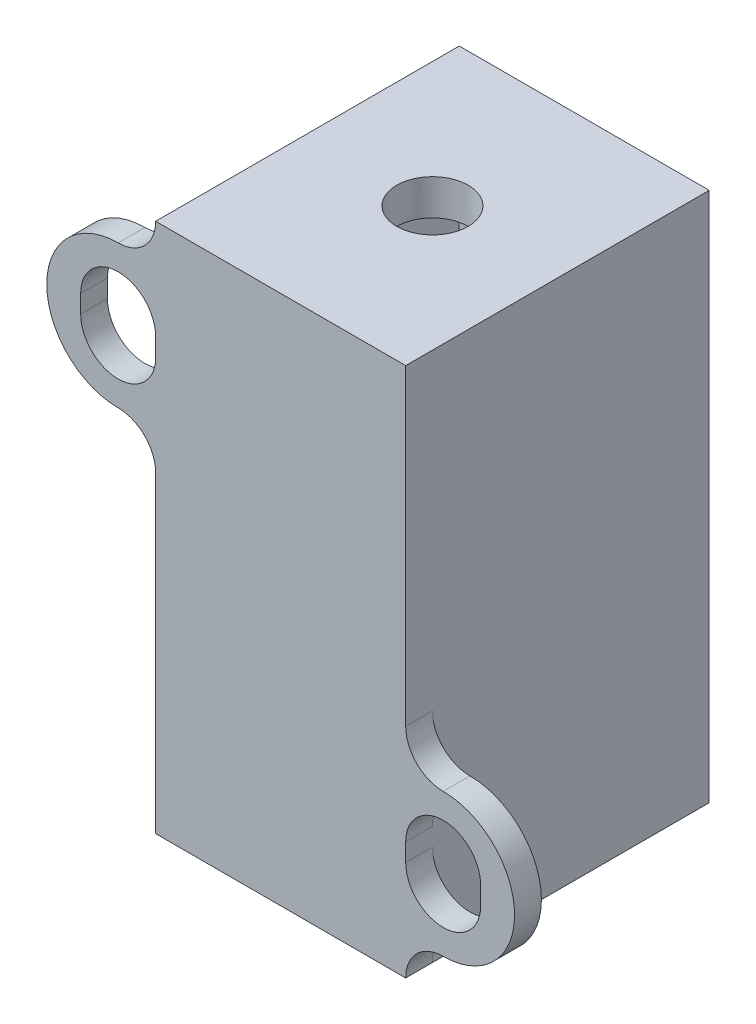
ISO-10303-21;
HEADER;
FILE_DESCRIPTION(('STEP AP214'),'2;1');
FILE_NAME('part.step','',(''),(''),'','','');
FILE_SCHEMA(('AUTOMOTIVE_DESIGN { 1 0 10303 214 1 1 1 1 }'));
ENDSEC;
DATA;
#1=APPLICATION_CONTEXT('core data for automotive mechanical design processes');
#2=APPLICATION_PROTOCOL_DEFINITION('international standard','automotive_design',2000,#1);
#3=PRODUCT_CONTEXT('',#1,'mechanical');
#4=PRODUCT('Part','Part','',(#3));
#5=PRODUCT_RELATED_PRODUCT_CATEGORY('part','',(#4));
#6=PRODUCT_DEFINITION_FORMATION('','',#4);
#7=PRODUCT_DEFINITION_CONTEXT('part definition',#1,'design');
#8=PRODUCT_DEFINITION('design','',#6,#7);
#9=PRODUCT_DEFINITION_SHAPE('','',#8);
#10=(LENGTH_UNIT() NAMED_UNIT(*) SI_UNIT(.MILLI.,.METRE.));
#11=(NAMED_UNIT(*) PLANE_ANGLE_UNIT() SI_UNIT($,.RADIAN.));
#12=(NAMED_UNIT(*) SI_UNIT($,.STERADIAN.) SOLID_ANGLE_UNIT());
#13=UNCERTAINTY_MEASURE_WITH_UNIT(LENGTH_MEASURE(1.E-05),#10,'distance_accuracy_value','');
#14=(GEOMETRIC_REPRESENTATION_CONTEXT(3) GLOBAL_UNCERTAINTY_ASSIGNED_CONTEXT((#13)) GLOBAL_UNIT_ASSIGNED_CONTEXT((#10,
#11,#12)) REPRESENTATION_CONTEXT('',''));
#15=CARTESIAN_POINT('',(0.,0.,0.));
#16=DIRECTION('',(0.,0.,1.));
#17=DIRECTION('',(1.,0.,0.));
#18=AXIS2_PLACEMENT_3D('',#15,#16,#17);
#19=CARTESIAN_POINT('',(14.,0.,17.));
#20=DIRECTION('',(-1.,0.,0.));
#21=DIRECTION('',(0.,0.,1.));
#22=AXIS2_PLACEMENT_3D('',#19,#20,#21);
#23=PLANE('',#22);
#24=DIRECTION('',(0.,0.,1.));
#25=VECTOR('',#24,1.);
#26=CARTESIAN_POINT('',(14.,5.6,15.5));
#27=LINE('',#26,#25);
#28=CARTESIAN_POINT('',(14.,5.6,15.5));
#29=VERTEX_POINT('',#28);
#30=CARTESIAN_POINT('',(14.,5.6,17.));
#31=VERTEX_POINT('',#30);
#32=EDGE_CURVE('E240',#29,#31,#27,.T.);
#33=ORIENTED_EDGE('',*,*,#32,.F.);
#34=DIRECTION('',(0.,1.,0.));
#35=VECTOR('',#34,1.);
#36=CARTESIAN_POINT('',(14.,0.,15.5));
#37=LINE('',#36,#35);
#38=CARTESIAN_POINT('',(14.,0.,15.5));
#39=VERTEX_POINT('',#38);
#40=EDGE_CURVE('E206',#39,#29,#37,.T.);
#41=ORIENTED_EDGE('',*,*,#40,.F.);
#42=DIRECTION('',(0.,0.,-1.));
#43=VECTOR('',#42,1.);
#44=CARTESIAN_POINT('',(14.,0.,17.));
#45=LINE('',#44,#43);
#46=CARTESIAN_POINT('',(14.,0.,0.));
#47=VERTEX_POINT('',#46);
#48=EDGE_CURVE('E371',#39,#47,#45,.T.);
#49=ORIENTED_EDGE('',*,*,#48,.T.);
#50=DIRECTION('',(0.,1.,0.));
#51=VECTOR('',#50,1.);
#52=CARTESIAN_POINT('',(14.,0.,0.));
#53=LINE('',#52,#51);
#54=CARTESIAN_POINT('',(14.,29.7,0.));
#55=VERTEX_POINT('',#54);
#56=EDGE_CURVE('E361',#47,#55,#53,.T.);
#57=ORIENTED_EDGE('',*,*,#56,.T.);
#58=DIRECTION('',(0.,0.,-1.));
#59=VECTOR('',#58,1.);
#60=CARTESIAN_POINT('',(14.,29.7,17.));
#61=LINE('',#60,#59);
#62=CARTESIAN_POINT('',(14.,29.7,17.));
#63=VERTEX_POINT('',#62);
#64=EDGE_CURVE('E368',#63,#55,#61,.T.);
#65=ORIENTED_EDGE('',*,*,#64,.F.);
#66=DIRECTION('',(0.,1.,0.));
#67=VECTOR('',#66,1.);
#68=CARTESIAN_POINT('',(14.,0.,17.));
#69=LINE('',#68,#67);
#70=CARTESIAN_POINT('',(14.,12.2,17.));
#71=VERTEX_POINT('',#70);
#72=EDGE_CURVE('E349',#71,#63,#69,.T.);
#73=ORIENTED_EDGE('',*,*,#72,.F.);
#74=DIRECTION('',(0.,0.,1.));
#75=VECTOR('',#74,1.);
#76=CARTESIAN_POINT('',(14.,12.2,15.5));
#77=LINE('',#76,#75);
#78=CARTESIAN_POINT('',(14.,12.2,15.5));
#79=VERTEX_POINT('',#78);
#80=EDGE_CURVE('E250',#79,#71,#77,.T.);
#81=ORIENTED_EDGE('',*,*,#80,.F.);
#82=CARTESIAN_POINT('',(14.,6.6,15.5));
#83=VERTEX_POINT('',#82);
#84=EDGE_CURVE('E220',#83,#79,#37,.T.);
#85=ORIENTED_EDGE('',*,*,#84,.F.);
#86=DIRECTION('',(0.,0.,1.));
#87=VECTOR('',#86,1.);
#88=CARTESIAN_POINT('',(14.,6.6,15.5));
#89=LINE('',#88,#87);
#90=CARTESIAN_POINT('',(14.,6.6,17.));
#91=VERTEX_POINT('',#90);
#92=EDGE_CURVE('E247',#83,#91,#89,.T.);
#93=ORIENTED_EDGE('',*,*,#92,.T.);
#94=EDGE_CURVE('E351',#31,#91,#69,.T.);
#95=ORIENTED_EDGE('',*,*,#94,.F.);
#96=EDGE_LOOP('',(#33,#41,#49,#57,#65,#73,#81,#85,#93,#95));
#97=FACE_BOUND('',#96,.T.);
#98=ADVANCED_FACE('F37',(#97),#23,.F.);
#99=CARTESIAN_POINT('',(0.,0.,17.));
#100=DIRECTION('',(1.,0.,0.));
#101=DIRECTION('',(0.,0.,-1.));
#102=AXIS2_PLACEMENT_3D('',#99,#100,#101);
#103=PLANE('',#102);
#104=DIRECTION('',(0.,0.,1.));
#105=VECTOR('',#104,1.);
#106=CARTESIAN_POINT('',(0.,24.1,15.5));
#107=LINE('',#106,#105);
#108=CARTESIAN_POINT('',(0.,24.1,15.5));
#109=VERTEX_POINT('',#108);
#110=CARTESIAN_POINT('',(0.,24.1,17.));
#111=VERTEX_POINT('',#110);
#112=EDGE_CURVE('E289',#109,#111,#107,.T.);
#113=ORIENTED_EDGE('',*,*,#112,.F.);
#114=DIRECTION('',(0.,-1.,0.));
#115=VECTOR('',#114,1.);
#116=CARTESIAN_POINT('',(0.,0.,15.5));
#117=LINE('',#116,#115);
#118=CARTESIAN_POINT('',(0.,29.7,15.5));
#119=VERTEX_POINT('',#118);
#120=EDGE_CURVE('E263',#119,#109,#117,.T.);
#121=ORIENTED_EDGE('',*,*,#120,.F.);
#122=DIRECTION('',(0.,0.,-1.));
#123=VECTOR('',#122,1.);
#124=CARTESIAN_POINT('',(0.,29.7,17.));
#125=LINE('',#124,#123);
#126=CARTESIAN_POINT('',(0.,29.7,0.));
#127=VERTEX_POINT('',#126);
#128=EDGE_CURVE('E355',#119,#127,#125,.T.);
#129=ORIENTED_EDGE('',*,*,#128,.T.);
#130=DIRECTION('',(0.,-1.,0.));
#131=VECTOR('',#130,1.);
#132=CARTESIAN_POINT('',(0.,0.,0.));
#133=LINE('',#132,#131);
#134=CARTESIAN_POINT('',(0.,0.,0.));
#135=VERTEX_POINT('',#134);
#136=EDGE_CURVE('E341',#127,#135,#133,.T.);
#137=ORIENTED_EDGE('',*,*,#136,.T.);
#138=DIRECTION('',(0.,0.,-1.));
#139=VECTOR('',#138,1.);
#140=CARTESIAN_POINT('',(0.,0.,17.));
#141=LINE('',#140,#139);
#142=CARTESIAN_POINT('',(0.,0.,17.));
#143=VERTEX_POINT('',#142);
#144=EDGE_CURVE('E11',#143,#135,#141,.T.);
#145=ORIENTED_EDGE('',*,*,#144,.F.);
#146=DIRECTION('',(0.,-1.,0.));
#147=VECTOR('',#146,1.);
#148=CARTESIAN_POINT('',(0.,0.,17.));
#149=LINE('',#148,#147);
#150=CARTESIAN_POINT('',(0.,17.5,17.));
#151=VERTEX_POINT('',#150);
#152=EDGE_CURVE('E342',#151,#143,#149,.T.);
#153=ORIENTED_EDGE('',*,*,#152,.F.);
#154=DIRECTION('',(0.,0.,1.));
#155=VECTOR('',#154,1.);
#156=CARTESIAN_POINT('',(0.,17.5,15.5));
#157=LINE('',#156,#155);
#158=CARTESIAN_POINT('',(0.,17.5,15.5));
#159=VERTEX_POINT('',#158);
#160=EDGE_CURVE('E299',#159,#151,#157,.T.);
#161=ORIENTED_EDGE('',*,*,#160,.F.);
#162=CARTESIAN_POINT('',(0.,23.1,15.5));
#163=VERTEX_POINT('',#162);
#164=EDGE_CURVE('E260',#163,#159,#117,.T.);
#165=ORIENTED_EDGE('',*,*,#164,.F.);
#166=DIRECTION('',(0.,0.,1.));
#167=VECTOR('',#166,1.);
#168=CARTESIAN_POINT('',(0.,23.1,15.5));
#169=LINE('',#168,#167);
#170=CARTESIAN_POINT('',(0.,23.1,17.));
#171=VERTEX_POINT('',#170);
#172=EDGE_CURVE('E296',#163,#171,#169,.T.);
#173=ORIENTED_EDGE('',*,*,#172,.T.);
#174=EDGE_CURVE('E344',#111,#171,#149,.T.);
#175=ORIENTED_EDGE('',*,*,#174,.F.);
#176=EDGE_LOOP('',(#113,#121,#129,#137,#145,#153,#161,#165,#173,#175));
#177=FACE_BOUND('',#176,.T.);
#178=ADVANCED_FACE('F39',(#177),#103,.F.);
#179=CARTESIAN_POINT('',(7.,0.,8.5));
#180=DIRECTION('',(0.,1.,0.));
#181=DIRECTION('',(0.,0.,1.));
#182=AXIS2_PLACEMENT_3D('',#179,#180,#181);
#183=CYLINDRICAL_SURFACE('',#182,2.);
#184=CARTESIAN_POINT('',(7.,29.7,8.5));
#185=DIRECTION('',(0.,1.,0.));
#186=DIRECTION('',(0.,0.,1.));
#187=AXIS2_PLACEMENT_3D('',#184,#185,#186);
#188=CIRCLE('',#187,2.);
#189=CARTESIAN_POINT('',(7.,29.7,10.5));
#190=VERTEX_POINT('',#189);
#191=EDGE_CURVE('E338',#190,#190,#188,.T.);
#192=ORIENTED_EDGE('',*,*,#191,.T.);
#193=EDGE_LOOP('',(#192));
#194=FACE_BOUND('',#193,.T.);
#195=CARTESIAN_POINT('',(7.,27.7,8.5));
#196=DIRECTION('',(0.,-1.,0.));
#197=DIRECTION('',(0.,0.,-1.));
#198=AXIS2_PLACEMENT_3D('',#195,#196,#197);
#199=CIRCLE('',#198,2.);
#200=CARTESIAN_POINT('',(7.,27.7,6.50000000000001));
#201=VERTEX_POINT('',#200);
#202=EDGE_CURVE('E337',#201,#201,#199,.F.);
#203=ORIENTED_EDGE('',*,*,#202,.F.);
#204=EDGE_LOOP('',(#203));
#205=FACE_BOUND('',#204,.T.);
#206=ADVANCED_FACE('F378',(#194,#205),#183,.F.);
#207=CARTESIAN_POINT('',(0.,0.,17.));
#208=DIRECTION('',(0.,1.,0.));
#209=DIRECTION('',(0.,0.,1.));
#210=AXIS2_PLACEMENT_3D('',#207,#208,#209);
#211=PLANE('',#210);
#212=CARTESIAN_POINT('',(7.,0.,8.5));
#213=DIRECTION('',(0.,-1.,0.));
#214=DIRECTION('',(0.,0.,-1.));
#215=AXIS2_PLACEMENT_3D('',#212,#213,#214);
#216=CIRCLE('',#215,4.);
#217=CARTESIAN_POINT('',(7.,0.,4.5));
#218=VERTEX_POINT('',#217);
#219=EDGE_CURVE('E334',#218,#218,#216,.T.);
#220=ORIENTED_EDGE('',*,*,#219,.F.);
#221=EDGE_LOOP('',(#220));
#222=FACE_BOUND('',#221,.T.);
#223=DIRECTION('',(1.,0.,0.));
#224=VECTOR('',#223,1.);
#225=CARTESIAN_POINT('',(0.,0.,0.));
#226=LINE('',#225,#224);
#227=EDGE_CURVE('E358',#135,#47,#226,.T.);
#228=ORIENTED_EDGE('',*,*,#227,.T.);
#229=ORIENTED_EDGE('',*,*,#48,.F.);
#230=CARTESIAN_POINT('',(14.,0.,17.));
#231=VERTEX_POINT('',#230);
#232=EDGE_CURVE('E46',#231,#39,#45,.T.);
#233=ORIENTED_EDGE('',*,*,#232,.F.);
#234=DIRECTION('',(1.,0.,0.));
#235=VECTOR('',#234,1.);
#236=CARTESIAN_POINT('',(0.,0.,17.));
#237=LINE('',#236,#235);
#238=EDGE_CURVE('E346',#143,#231,#237,.T.);
#239=ORIENTED_EDGE('',*,*,#238,.F.);
#240=ORIENTED_EDGE('',*,*,#144,.T.);
#241=EDGE_LOOP('',(#228,#229,#233,#239,#240));
#242=FACE_BOUND('',#241,.T.);
#243=ADVANCED_FACE('F380',(#222,#242),#211,.F.);
#244=CARTESIAN_POINT('',(0.,29.7,17.));
#245=DIRECTION('',(0.,-1.,0.));
#246=DIRECTION('',(0.,0.,-1.));
#247=AXIS2_PLACEMENT_3D('',#244,#245,#246);
#248=PLANE('',#247);
#249=ORIENTED_EDGE('',*,*,#191,.F.);
#250=EDGE_LOOP('',(#249));
#251=FACE_BOUND('',#250,.T.);
#252=DIRECTION('',(-1.,0.,0.));
#253=VECTOR('',#252,1.);
#254=CARTESIAN_POINT('',(0.,29.7,0.));
#255=LINE('',#254,#253);
#256=EDGE_CURVE('E345',#55,#127,#255,.T.);
#257=ORIENTED_EDGE('',*,*,#256,.T.);
#258=ORIENTED_EDGE('',*,*,#128,.F.);
#259=CARTESIAN_POINT('',(0.,29.7,17.));
#260=VERTEX_POINT('',#259);
#261=EDGE_CURVE('E365',#260,#119,#125,.T.);
#262=ORIENTED_EDGE('',*,*,#261,.F.);
#263=DIRECTION('',(-1.,0.,0.));
#264=VECTOR('',#263,1.);
#265=CARTESIAN_POINT('',(0.,29.7,17.));
#266=LINE('',#265,#264);
#267=EDGE_CURVE('E352',#63,#260,#266,.T.);
#268=ORIENTED_EDGE('',*,*,#267,.F.);
#269=ORIENTED_EDGE('',*,*,#64,.T.);
#270=EDGE_LOOP('',(#257,#258,#262,#268,#269));
#271=FACE_BOUND('',#270,.T.);
#272=ADVANCED_FACE('F387',(#251,#271),#248,.F.);
#273=CARTESIAN_POINT('',(0.,0.,17.));
#274=DIRECTION('',(0.,0.,-1.));
#275=DIRECTION('',(-1.,0.,0.));
#276=AXIS2_PLACEMENT_3D('',#273,#274,#275);
#277=PLANE('',#276);
#278=CARTESIAN_POINT('',(16.1,5.6,17.));
#279=DIRECTION('',(0.,0.,1.));
#280=DIRECTION('',(1.,0.,0.));
#281=AXIS2_PLACEMENT_3D('',#278,#279,#280);
#282=CIRCLE('',#281,2.1);
#283=CARTESIAN_POINT('',(18.2,5.6,17.));
#284=VERTEX_POINT('',#283);
#285=EDGE_CURVE('E62',#31,#284,#282,.T.);
#286=ORIENTED_EDGE('',*,*,#285,.F.);
#287=ORIENTED_EDGE('',*,*,#94,.T.);
#288=CARTESIAN_POINT('',(16.1,6.6,17.));
#289=DIRECTION('',(0.,0.,1.));
#290=DIRECTION('',(1.,0.,0.));
#291=AXIS2_PLACEMENT_3D('',#288,#289,#290);
#292=CIRCLE('',#291,2.1);
#293=CARTESIAN_POINT('',(18.2,6.6,17.));
#294=VERTEX_POINT('',#293);
#295=EDGE_CURVE('E235',#294,#91,#292,.T.);
#296=ORIENTED_EDGE('',*,*,#295,.F.);
#297=DIRECTION('',(0.,-1.,0.));
#298=VECTOR('',#297,1.);
#299=CARTESIAN_POINT('',(18.2,0.,17.));
#300=LINE('',#299,#298);
#301=EDGE_CURVE('E237',#294,#284,#300,.T.);
#302=ORIENTED_EDGE('',*,*,#301,.T.);
#303=EDGE_LOOP('',(#286,#287,#296,#302));
#304=FACE_BOUND('',#303,.T.);
#305=CARTESIAN_POINT('',(-2.1,24.1,17.));
#306=DIRECTION('',(0.,0.,1.));
#307=DIRECTION('',(1.,0.,0.));
#308=AXIS2_PLACEMENT_3D('',#305,#306,#307);
#309=CIRCLE('',#308,2.1);
#310=CARTESIAN_POINT('',(-4.20000000000001,24.1,17.));
#311=VERTEX_POINT('',#310);
#312=EDGE_CURVE('E282',#111,#311,#309,.T.);
#313=ORIENTED_EDGE('',*,*,#312,.F.);
#314=ORIENTED_EDGE('',*,*,#174,.T.);
#315=CARTESIAN_POINT('',(-2.1,23.1,17.));
#316=DIRECTION('',(0.,0.,1.));
#317=DIRECTION('',(1.,0.,0.));
#318=AXIS2_PLACEMENT_3D('',#315,#316,#317);
#319=CIRCLE('',#318,2.1);
#320=CARTESIAN_POINT('',(-4.20000000000001,23.1,17.));
#321=VERTEX_POINT('',#320);
#322=EDGE_CURVE('E277',#321,#171,#319,.T.);
#323=ORIENTED_EDGE('',*,*,#322,.F.);
#324=DIRECTION('',(0.,1.,0.));
#325=VECTOR('',#324,1.);
#326=CARTESIAN_POINT('',(-4.20000000000001,0.,17.));
#327=LINE('',#326,#325);
#328=EDGE_CURVE('E279',#321,#311,#327,.T.);
#329=ORIENTED_EDGE('',*,*,#328,.T.);
#330=EDGE_LOOP('',(#313,#314,#323,#329));
#331=FACE_BOUND('',#330,.T.);
#332=ORIENTED_EDGE('',*,*,#267,.T.);
#333=CARTESIAN_POINT('',(-2.1,29.7,17.));
#334=DIRECTION('',(0.,0.,1.));
#335=DIRECTION('',(1.,0.,0.));
#336=AXIS2_PLACEMENT_3D('',#333,#334,#335);
#337=CIRCLE('',#336,2.1);
#338=CARTESIAN_POINT('',(-2.1,27.6,17.));
#339=VERTEX_POINT('',#338);
#340=EDGE_CURVE('E257',#339,#260,#337,.T.);
#341=ORIENTED_EDGE('',*,*,#340,.F.);
#342=CARTESIAN_POINT('',(-2.1,23.6,17.));
#343=DIRECTION('',(0.,0.,1.));
#344=DIRECTION('',(1.,0.,0.));
#345=AXIS2_PLACEMENT_3D('',#342,#343,#344);
#346=CIRCLE('',#345,4.);
#347=CARTESIAN_POINT('',(-2.1,19.6,17.));
#348=VERTEX_POINT('',#347);
#349=EDGE_CURVE('E242',#339,#348,#346,.T.);
#350=ORIENTED_EDGE('',*,*,#349,.T.);
#351=CARTESIAN_POINT('',(-2.1,17.5,17.));
#352=DIRECTION('',(0.,0.,1.));
#353=DIRECTION('',(1.,0.,0.));
#354=AXIS2_PLACEMENT_3D('',#351,#352,#353);
#355=CIRCLE('',#354,2.1);
#356=EDGE_CURVE('E275',#348,#151,#355,.F.);
#357=ORIENTED_EDGE('',*,*,#356,.T.);
#358=ORIENTED_EDGE('',*,*,#152,.T.);
#359=ORIENTED_EDGE('',*,*,#238,.T.);
#360=CARTESIAN_POINT('',(16.1,0.,17.));
#361=DIRECTION('',(0.,0.,1.));
#362=DIRECTION('',(1.,0.,0.));
#363=AXIS2_PLACEMENT_3D('',#360,#361,#362);
#364=CIRCLE('',#363,2.1);
#365=CARTESIAN_POINT('',(16.1,2.1,17.));
#366=VERTEX_POINT('',#365);
#367=EDGE_CURVE('E231',#366,#231,#364,.T.);
#368=ORIENTED_EDGE('',*,*,#367,.F.);
#369=CARTESIAN_POINT('',(16.1,6.1,17.));
#370=DIRECTION('',(0.,0.,1.));
#371=DIRECTION('',(1.,0.,0.));
#372=AXIS2_PLACEMENT_3D('',#369,#370,#371);
#373=CIRCLE('',#372,4.);
#374=CARTESIAN_POINT('',(16.1,10.1,17.));
#375=VERTEX_POINT('',#374);
#376=EDGE_CURVE('E202',#366,#375,#373,.T.);
#377=ORIENTED_EDGE('',*,*,#376,.T.);
#378=CARTESIAN_POINT('',(16.1,12.2,17.));
#379=DIRECTION('',(0.,0.,1.));
#380=DIRECTION('',(1.,0.,0.));
#381=AXIS2_PLACEMENT_3D('',#378,#379,#380);
#382=CIRCLE('',#381,2.1);
#383=EDGE_CURVE('E54',#375,#71,#382,.F.);
#384=ORIENTED_EDGE('',*,*,#383,.T.);
#385=ORIENTED_EDGE('',*,*,#72,.T.);
#386=EDGE_LOOP('',(#332,#341,#350,#357,#358,#359,#368,#377,#384,#385));
#387=FACE_BOUND('',#386,.T.);
#388=ADVANCED_FACE('F403',(#304,#331,#387),#277,.F.);
#389=CARTESIAN_POINT('',(0.,0.,0.));
#390=DIRECTION('',(0.,0.,-1.));
#391=DIRECTION('',(-1.,0.,0.));
#392=AXIS2_PLACEMENT_3D('',#389,#390,#391);
#393=PLANE('',#392);
#394=ORIENTED_EDGE('',*,*,#136,.F.);
#395=ORIENTED_EDGE('',*,*,#256,.F.);
#396=ORIENTED_EDGE('',*,*,#56,.F.);
#397=ORIENTED_EDGE('',*,*,#227,.F.);
#398=EDGE_LOOP('',(#394,#395,#396,#397));
#399=FACE_BOUND('',#398,.T.);
#400=ADVANCED_FACE('F405',(#399),#393,.T.);
#401=CARTESIAN_POINT('',(7.,27.7,8.5));
#402=DIRECTION('',(0.,-1.,0.));
#403=DIRECTION('',(0.,0.,-1.));
#404=AXIS2_PLACEMENT_3D('',#401,#402,#403);
#405=PLANE('',#404);
#406=ORIENTED_EDGE('',*,*,#202,.T.);
#407=EDGE_LOOP('',(#406));
#408=FACE_BOUND('',#407,.T.);
#409=DIRECTION('',(1.,0.,0.));
#410=VECTOR('',#409,1.);
#411=CARTESIAN_POINT('',(2.,27.7,2.));
#412=LINE('',#411,#410);
#413=CARTESIAN_POINT('',(2.,27.7,2.));
#414=VERTEX_POINT('',#413);
#415=CARTESIAN_POINT('',(12.,27.7,2.));
#416=VERTEX_POINT('',#415);
#417=EDGE_CURVE('E303',#414,#416,#412,.T.);
#418=ORIENTED_EDGE('',*,*,#417,.T.);
#419=DIRECTION('',(0.,0.,1.));
#420=VECTOR('',#419,1.);
#421=CARTESIAN_POINT('',(12.,27.7,2.));
#422=LINE('',#421,#420);
#423=CARTESIAN_POINT('',(12.,27.7,15.));
#424=VERTEX_POINT('',#423);
#425=EDGE_CURVE('E306',#416,#424,#422,.T.);
#426=ORIENTED_EDGE('',*,*,#425,.T.);
#427=DIRECTION('',(-1.,0.,0.));
#428=VECTOR('',#427,1.);
#429=CARTESIAN_POINT('',(12.,27.7,15.));
#430=LINE('',#429,#428);
#431=CARTESIAN_POINT('',(2.,27.7,15.));
#432=VERTEX_POINT('',#431);
#433=EDGE_CURVE('E310',#424,#432,#430,.T.);
#434=ORIENTED_EDGE('',*,*,#433,.T.);
#435=DIRECTION('',(0.,0.,-1.));
#436=VECTOR('',#435,1.);
#437=CARTESIAN_POINT('',(2.,27.7,15.));
#438=LINE('',#437,#436);
#439=EDGE_CURVE('E313',#432,#414,#438,.T.);
#440=ORIENTED_EDGE('',*,*,#439,.T.);
#441=EDGE_LOOP('',(#418,#426,#434,#440));
#442=FACE_BOUND('',#441,.T.);
#443=ADVANCED_FACE('F375',(#408,#442),#405,.T.);
#444=CARTESIAN_POINT('',(7.,27.7,8.5));
#445=DIRECTION('',(0.,-1.,0.));
#446=DIRECTION('',(0.,0.,-1.));
#447=AXIS2_PLACEMENT_3D('',#444,#445,#446);
#448=CYLINDRICAL_SURFACE('',#447,4.);
#449=CARTESIAN_POINT('',(7.,2.,8.5));
#450=DIRECTION('',(0.,-1.,0.));
#451=DIRECTION('',(0.,0.,-1.));
#452=AXIS2_PLACEMENT_3D('',#449,#450,#451);
#453=CIRCLE('',#452,4.);
#454=CARTESIAN_POINT('',(7.,2.,4.5));
#455=VERTEX_POINT('',#454);
#456=EDGE_CURVE('E41',#455,#455,#453,.F.);
#457=ORIENTED_EDGE('',*,*,#456,.T.);
#458=EDGE_LOOP('',(#457));
#459=FACE_BOUND('',#458,.T.);
#460=ORIENTED_EDGE('',*,*,#219,.T.);
#461=EDGE_LOOP('',(#460));
#462=FACE_BOUND('',#461,.T.);
#463=ADVANCED_FACE('F509',(#459,#462),#448,.F.);
#464=CARTESIAN_POINT('',(0.,2.,0.));
#465=DIRECTION('',(0.,-1.,0.));
#466=DIRECTION('',(0.,0.,-1.));
#467=AXIS2_PLACEMENT_3D('',#464,#465,#466);
#468=PLANE('',#467);
#469=DIRECTION('',(1.,0.,0.));
#470=VECTOR('',#469,1.);
#471=CARTESIAN_POINT('',(2.,2.,2.));
#472=LINE('',#471,#470);
#473=CARTESIAN_POINT('',(2.,2.,2.));
#474=VERTEX_POINT('',#473);
#475=CARTESIAN_POINT('',(12.,2.,2.));
#476=VERTEX_POINT('',#475);
#477=EDGE_CURVE('E288',#474,#476,#472,.T.);
#478=ORIENTED_EDGE('',*,*,#477,.F.);
#479=DIRECTION('',(0.,0.,-1.));
#480=VECTOR('',#479,1.);
#481=CARTESIAN_POINT('',(2.,2.,15.));
#482=LINE('',#481,#480);
#483=CARTESIAN_POINT('',(2.,2.,15.));
#484=VERTEX_POINT('',#483);
#485=EDGE_CURVE('E307',#484,#474,#482,.T.);
#486=ORIENTED_EDGE('',*,*,#485,.F.);
#487=DIRECTION('',(-1.,0.,0.));
#488=VECTOR('',#487,1.);
#489=CARTESIAN_POINT('',(12.,2.,15.));
#490=LINE('',#489,#488);
#491=CARTESIAN_POINT('',(12.,2.,15.));
#492=VERTEX_POINT('',#491);
#493=EDGE_CURVE('E322',#492,#484,#490,.T.);
#494=ORIENTED_EDGE('',*,*,#493,.F.);
#495=DIRECTION('',(0.,0.,1.));
#496=VECTOR('',#495,1.);
#497=CARTESIAN_POINT('',(12.,2.,2.));
#498=LINE('',#497,#496);
#499=EDGE_CURVE('E319',#476,#492,#498,.T.);
#500=ORIENTED_EDGE('',*,*,#499,.F.);
#501=EDGE_LOOP('',(#478,#486,#494,#500));
#502=FACE_BOUND('',#501,.T.);
#503=ORIENTED_EDGE('',*,*,#456,.F.);
#504=EDGE_LOOP('',(#503));
#505=FACE_BOUND('',#504,.T.);
#506=ADVANCED_FACE('F505',(#502,#505),#468,.F.);
#507=CARTESIAN_POINT('',(2.,27.7,2.));
#508=DIRECTION('',(0.,0.,-1.));
#509=DIRECTION('',(-1.,0.,0.));
#510=AXIS2_PLACEMENT_3D('',#507,#508,#509);
#511=PLANE('',#510);
#512=ORIENTED_EDGE('',*,*,#477,.T.);
#513=DIRECTION('',(0.,-1.,0.));
#514=VECTOR('',#513,1.);
#515=CARTESIAN_POINT('',(12.,27.7,2.));
#516=LINE('',#515,#514);
#517=EDGE_CURVE('E316',#416,#476,#516,.T.);
#518=ORIENTED_EDGE('',*,*,#517,.F.);
#519=ORIENTED_EDGE('',*,*,#417,.F.);
#520=DIRECTION('',(0.,-1.,0.));
#521=VECTOR('',#520,1.);
#522=CARTESIAN_POINT('',(2.,27.7,2.));
#523=LINE('',#522,#521);
#524=EDGE_CURVE('E327',#414,#474,#523,.T.);
#525=ORIENTED_EDGE('',*,*,#524,.T.);
#526=EDGE_LOOP('',(#512,#518,#519,#525));
#527=FACE_BOUND('',#526,.T.);
#528=ADVANCED_FACE('F508',(#527),#511,.F.);
#529=CARTESIAN_POINT('',(2.,27.7,15.));
#530=DIRECTION('',(-1.,0.,0.));
#531=DIRECTION('',(0.,0.,1.));
#532=AXIS2_PLACEMENT_3D('',#529,#530,#531);
#533=PLANE('',#532);
#534=ORIENTED_EDGE('',*,*,#485,.T.);
#535=ORIENTED_EDGE('',*,*,#524,.F.);
#536=ORIENTED_EDGE('',*,*,#439,.F.);
#537=DIRECTION('',(0.,-1.,0.));
#538=VECTOR('',#537,1.);
#539=CARTESIAN_POINT('',(2.,27.7,15.));
#540=LINE('',#539,#538);
#541=EDGE_CURVE('E329',#432,#484,#540,.T.);
#542=ORIENTED_EDGE('',*,*,#541,.T.);
#543=EDGE_LOOP('',(#534,#535,#536,#542));
#544=FACE_BOUND('',#543,.T.);
#545=ADVANCED_FACE('F511',(#544),#533,.F.);
#546=CARTESIAN_POINT('',(12.,27.7,15.));
#547=DIRECTION('',(0.,0.,1.));
#548=DIRECTION('',(1.,0.,0.));
#549=AXIS2_PLACEMENT_3D('',#546,#547,#548);
#550=PLANE('',#549);
#551=ORIENTED_EDGE('',*,*,#493,.T.);
#552=ORIENTED_EDGE('',*,*,#541,.F.);
#553=ORIENTED_EDGE('',*,*,#433,.F.);
#554=DIRECTION('',(0.,-1.,0.));
#555=VECTOR('',#554,1.);
#556=CARTESIAN_POINT('',(12.,27.7,15.));
#557=LINE('',#556,#555);
#558=EDGE_CURVE('E331',#424,#492,#557,.T.);
#559=ORIENTED_EDGE('',*,*,#558,.T.);
#560=EDGE_LOOP('',(#551,#552,#553,#559));
#561=FACE_BOUND('',#560,.T.);
#562=ADVANCED_FACE('F514',(#561),#550,.F.);
#563=CARTESIAN_POINT('',(12.,27.7,2.));
#564=DIRECTION('',(1.,0.,0.));
#565=DIRECTION('',(0.,0.,-1.));
#566=AXIS2_PLACEMENT_3D('',#563,#564,#565);
#567=PLANE('',#566);
#568=ORIENTED_EDGE('',*,*,#499,.T.);
#569=ORIENTED_EDGE('',*,*,#558,.F.);
#570=ORIENTED_EDGE('',*,*,#425,.F.);
#571=ORIENTED_EDGE('',*,*,#517,.T.);
#572=EDGE_LOOP('',(#568,#569,#570,#571));
#573=FACE_BOUND('',#572,.T.);
#574=ADVANCED_FACE('F504',(#573),#567,.F.);
#575=CARTESIAN_POINT('',(-2.1,23.6,15.5));
#576=DIRECTION('',(0.,0.,1.));
#577=DIRECTION('',(1.,0.,0.));
#578=AXIS2_PLACEMENT_3D('',#575,#576,#577);
#579=CYLINDRICAL_SURFACE('',#578,4.);
#580=ORIENTED_EDGE('',*,*,#349,.F.);
#581=DIRECTION('',(0.,0.,1.));
#582=VECTOR('',#581,1.);
#583=CARTESIAN_POINT('',(-2.1,27.6,15.5));
#584=LINE('',#583,#582);
#585=CARTESIAN_POINT('',(-2.1,27.6,15.5));
#586=VERTEX_POINT('',#585);
#587=EDGE_CURVE('E286',#586,#339,#584,.T.);
#588=ORIENTED_EDGE('',*,*,#587,.F.);
#589=CARTESIAN_POINT('',(-2.1,23.6,15.5));
#590=DIRECTION('',(0.,0.,1.));
#591=DIRECTION('',(1.,0.,0.));
#592=AXIS2_PLACEMENT_3D('',#589,#590,#591);
#593=CIRCLE('',#592,4.);
#594=CARTESIAN_POINT('',(-2.1,19.6,15.5));
#595=VERTEX_POINT('',#594);
#596=EDGE_CURVE('E253',#586,#595,#593,.T.);
#597=ORIENTED_EDGE('',*,*,#596,.T.);
#598=DIRECTION('',(0.,0.,1.));
#599=VECTOR('',#598,1.);
#600=CARTESIAN_POINT('',(-2.1,19.6,15.5));
#601=LINE('',#600,#599);
#602=EDGE_CURVE('E272',#595,#348,#601,.T.);
#603=ORIENTED_EDGE('',*,*,#602,.T.);
#604=EDGE_LOOP('',(#580,#588,#597,#603));
#605=FACE_BOUND('',#604,.T.);
#606=ADVANCED_FACE('F454',(#605),#579,.T.);
#607=CARTESIAN_POINT('',(-2.1,29.7,15.5));
#608=DIRECTION('',(0.,0.,1.));
#609=DIRECTION('',(1.,0.,0.));
#610=AXIS2_PLACEMENT_3D('',#607,#608,#609);
#611=CYLINDRICAL_SURFACE('',#610,2.1);
#612=ORIENTED_EDGE('',*,*,#340,.T.);
#613=ORIENTED_EDGE('',*,*,#261,.T.);
#614=CARTESIAN_POINT('',(-2.1,29.7,15.5));
#615=DIRECTION('',(0.,0.,1.));
#616=DIRECTION('',(1.,0.,0.));
#617=AXIS2_PLACEMENT_3D('',#614,#615,#616);
#618=CIRCLE('',#617,2.1);
#619=EDGE_CURVE('E270',#586,#119,#618,.T.);
#620=ORIENTED_EDGE('',*,*,#619,.F.);
#621=ORIENTED_EDGE('',*,*,#587,.T.);
#622=EDGE_LOOP('',(#612,#613,#620,#621));
#623=FACE_BOUND('',#622,.T.);
#624=ADVANCED_FACE('F426',(#623),#611,.F.);
#625=CARTESIAN_POINT('',(-2.1,24.1,15.5));
#626=DIRECTION('',(0.,0.,1.));
#627=DIRECTION('',(1.,0.,0.));
#628=AXIS2_PLACEMENT_3D('',#625,#626,#627);
#629=CYLINDRICAL_SURFACE('',#628,2.1);
#630=ORIENTED_EDGE('',*,*,#312,.T.);
#631=DIRECTION('',(0.,0.,1.));
#632=VECTOR('',#631,1.);
#633=CARTESIAN_POINT('',(-4.20000000000001,24.1,15.5));
#634=LINE('',#633,#632);
#635=CARTESIAN_POINT('',(-4.20000000000001,24.1,15.5));
#636=VERTEX_POINT('',#635);
#637=EDGE_CURVE('E292',#636,#311,#634,.T.);
#638=ORIENTED_EDGE('',*,*,#637,.F.);
#639=CARTESIAN_POINT('',(-2.1,24.1,15.5));
#640=DIRECTION('',(0.,0.,1.));
#641=DIRECTION('',(1.,0.,0.));
#642=AXIS2_PLACEMENT_3D('',#639,#640,#641);
#643=CIRCLE('',#642,2.1);
#644=EDGE_CURVE('E268',#109,#636,#643,.T.);
#645=ORIENTED_EDGE('',*,*,#644,.F.);
#646=ORIENTED_EDGE('',*,*,#112,.T.);
#647=EDGE_LOOP('',(#630,#638,#645,#646));
#648=FACE_BOUND('',#647,.T.);
#649=ADVANCED_FACE('F436',(#648),#629,.F.);
#650=CARTESIAN_POINT('',(-4.20000000000001,0.,15.5));
#651=DIRECTION('',(1.,0.,0.));
#652=DIRECTION('',(0.,0.,-1.));
#653=AXIS2_PLACEMENT_3D('',#650,#651,#652);
#654=PLANE('',#653);
#655=ORIENTED_EDGE('',*,*,#328,.F.);
#656=DIRECTION('',(0.,0.,1.));
#657=VECTOR('',#656,1.);
#658=CARTESIAN_POINT('',(-4.20000000000001,23.1,15.5));
#659=LINE('',#658,#657);
#660=CARTESIAN_POINT('',(-4.20000000000001,23.1,15.5));
#661=VERTEX_POINT('',#660);
#662=EDGE_CURVE('E294',#661,#321,#659,.T.);
#663=ORIENTED_EDGE('',*,*,#662,.F.);
#664=DIRECTION('',(0.,1.,0.));
#665=VECTOR('',#664,1.);
#666=CARTESIAN_POINT('',(-4.20000000000001,0.,15.5));
#667=LINE('',#666,#665);
#668=EDGE_CURVE('E265',#661,#636,#667,.T.);
#669=ORIENTED_EDGE('',*,*,#668,.T.);
#670=ORIENTED_EDGE('',*,*,#637,.T.);
#671=EDGE_LOOP('',(#655,#663,#669,#670));
#672=FACE_BOUND('',#671,.T.);
#673=ADVANCED_FACE('F439',(#672),#654,.T.);
#674=CARTESIAN_POINT('',(-2.1,23.1,15.5));
#675=DIRECTION('',(0.,0.,1.));
#676=DIRECTION('',(1.,0.,0.));
#677=AXIS2_PLACEMENT_3D('',#674,#675,#676);
#678=CYLINDRICAL_SURFACE('',#677,2.1);
#679=ORIENTED_EDGE('',*,*,#322,.T.);
#680=ORIENTED_EDGE('',*,*,#172,.F.);
#681=CARTESIAN_POINT('',(-2.1,23.1,15.5));
#682=DIRECTION('',(0.,0.,1.));
#683=DIRECTION('',(1.,0.,0.));
#684=AXIS2_PLACEMENT_3D('',#681,#682,#683);
#685=CIRCLE('',#684,2.1);
#686=EDGE_CURVE('E262',#661,#163,#685,.T.);
#687=ORIENTED_EDGE('',*,*,#686,.F.);
#688=ORIENTED_EDGE('',*,*,#662,.T.);
#689=EDGE_LOOP('',(#679,#680,#687,#688));
#690=FACE_BOUND('',#689,.T.);
#691=ADVANCED_FACE('F445',(#690),#678,.F.);
#692=CARTESIAN_POINT('',(-2.1,17.5,15.5));
#693=DIRECTION('',(0.,0.,1.));
#694=DIRECTION('',(1.,0.,0.));
#695=AXIS2_PLACEMENT_3D('',#692,#693,#694);
#696=CYLINDRICAL_SURFACE('',#695,2.1);
#697=ORIENTED_EDGE('',*,*,#356,.F.);
#698=ORIENTED_EDGE('',*,*,#602,.F.);
#699=CARTESIAN_POINT('',(-2.1,17.5,15.5));
#700=DIRECTION('',(0.,0.,1.));
#701=DIRECTION('',(1.,0.,0.));
#702=AXIS2_PLACEMENT_3D('',#699,#700,#701);
#703=CIRCLE('',#702,2.1);
#704=EDGE_CURVE('E256',#595,#159,#703,.F.);
#705=ORIENTED_EDGE('',*,*,#704,.T.);
#706=ORIENTED_EDGE('',*,*,#160,.T.);
#707=EDGE_LOOP('',(#697,#698,#705,#706));
#708=FACE_BOUND('',#707,.T.);
#709=ADVANCED_FACE('F452',(#708),#696,.F.);
#710=CARTESIAN_POINT('',(0.,0.,15.5));
#711=DIRECTION('',(0.,0.,1.));
#712=DIRECTION('',(1.,0.,0.));
#713=AXIS2_PLACEMENT_3D('',#710,#711,#712);
#714=PLANE('',#713);
#715=ORIENTED_EDGE('',*,*,#596,.F.);
#716=ORIENTED_EDGE('',*,*,#619,.T.);
#717=ORIENTED_EDGE('',*,*,#120,.T.);
#718=ORIENTED_EDGE('',*,*,#644,.T.);
#719=ORIENTED_EDGE('',*,*,#668,.F.);
#720=ORIENTED_EDGE('',*,*,#686,.T.);
#721=ORIENTED_EDGE('',*,*,#164,.T.);
#722=ORIENTED_EDGE('',*,*,#704,.F.);
#723=EDGE_LOOP('',(#715,#716,#717,#718,#719,#720,#721,#722));
#724=FACE_BOUND('',#723,.T.);
#725=ADVANCED_FACE('F432',(#724),#714,.F.);
#726=CARTESIAN_POINT('',(16.1,0.,15.5));
#727=DIRECTION('',(0.,0.,1.));
#728=DIRECTION('',(1.,0.,0.));
#729=AXIS2_PLACEMENT_3D('',#726,#727,#728);
#730=CYLINDRICAL_SURFACE('',#729,2.1);
#731=ORIENTED_EDGE('',*,*,#367,.T.);
#732=ORIENTED_EDGE('',*,*,#232,.T.);
#733=CARTESIAN_POINT('',(16.1,0.,15.5));
#734=DIRECTION('',(0.,0.,1.));
#735=DIRECTION('',(1.,0.,0.));
#736=AXIS2_PLACEMENT_3D('',#733,#734,#735);
#737=CIRCLE('',#736,2.1);
#738=CARTESIAN_POINT('',(16.1,2.1,15.5));
#739=VERTEX_POINT('',#738);
#740=EDGE_CURVE('E209',#739,#39,#737,.T.);
#741=ORIENTED_EDGE('',*,*,#740,.F.);
#742=DIRECTION('',(0.,0.,1.));
#743=VECTOR('',#742,1.);
#744=CARTESIAN_POINT('',(16.1,2.1,15.5));
#745=LINE('',#744,#743);
#746=EDGE_CURVE('E197',#739,#366,#745,.T.);
#747=ORIENTED_EDGE('',*,*,#746,.T.);
#748=EDGE_LOOP('',(#731,#732,#741,#747));
#749=FACE_BOUND('',#748,.T.);
#750=ADVANCED_FACE('F210',(#749),#730,.F.);
#751=CARTESIAN_POINT('',(16.1,5.6,15.5));
#752=DIRECTION('',(0.,0.,1.));
#753=DIRECTION('',(1.,0.,0.));
#754=AXIS2_PLACEMENT_3D('',#751,#752,#753);
#755=CYLINDRICAL_SURFACE('',#754,2.1);
#756=ORIENTED_EDGE('',*,*,#285,.T.);
#757=DIRECTION('',(0.,0.,1.));
#758=VECTOR('',#757,1.);
#759=CARTESIAN_POINT('',(18.2,5.6,15.5));
#760=LINE('',#759,#758);
#761=CARTESIAN_POINT('',(18.2,5.6,15.5));
#762=VERTEX_POINT('',#761);
#763=EDGE_CURVE('E243',#762,#284,#760,.T.);
#764=ORIENTED_EDGE('',*,*,#763,.F.);
#765=CARTESIAN_POINT('',(16.1,5.6,15.5));
#766=DIRECTION('',(0.,0.,1.));
#767=DIRECTION('',(1.,0.,0.));
#768=AXIS2_PLACEMENT_3D('',#765,#766,#767);
#769=CIRCLE('',#768,2.1);
#770=EDGE_CURVE('E229',#29,#762,#769,.T.);
#771=ORIENTED_EDGE('',*,*,#770,.F.);
#772=ORIENTED_EDGE('',*,*,#32,.T.);
#773=EDGE_LOOP('',(#756,#764,#771,#772));
#774=FACE_BOUND('',#773,.T.);
#775=ADVANCED_FACE('F466',(#774),#755,.F.);
#776=CARTESIAN_POINT('',(18.2,0.,15.5));
#777=DIRECTION('',(-1.,0.,0.));
#778=DIRECTION('',(0.,0.,1.));
#779=AXIS2_PLACEMENT_3D('',#776,#777,#778);
#780=PLANE('',#779);
#781=ORIENTED_EDGE('',*,*,#301,.F.);
#782=DIRECTION('',(0.,0.,1.));
#783=VECTOR('',#782,1.);
#784=CARTESIAN_POINT('',(18.2,6.6,15.5));
#785=LINE('',#784,#783);
#786=CARTESIAN_POINT('',(18.2,6.6,15.5));
#787=VERTEX_POINT('',#786);
#788=EDGE_CURVE('E245',#787,#294,#785,.T.);
#789=ORIENTED_EDGE('',*,*,#788,.F.);
#790=DIRECTION('',(0.,-1.,0.));
#791=VECTOR('',#790,1.);
#792=CARTESIAN_POINT('',(18.2,0.,15.5));
#793=LINE('',#792,#791);
#794=EDGE_CURVE('E226',#787,#762,#793,.T.);
#795=ORIENTED_EDGE('',*,*,#794,.T.);
#796=ORIENTED_EDGE('',*,*,#763,.T.);
#797=EDGE_LOOP('',(#781,#789,#795,#796));
#798=FACE_BOUND('',#797,.T.);
#799=ADVANCED_FACE('F469',(#798),#780,.T.);
#800=CARTESIAN_POINT('',(16.1,6.6,15.5));
#801=DIRECTION('',(0.,0.,1.));
#802=DIRECTION('',(1.,0.,0.));
#803=AXIS2_PLACEMENT_3D('',#800,#801,#802);
#804=CYLINDRICAL_SURFACE('',#803,2.1);
#805=ORIENTED_EDGE('',*,*,#295,.T.);
#806=ORIENTED_EDGE('',*,*,#92,.F.);
#807=CARTESIAN_POINT('',(16.1,6.6,15.5));
#808=DIRECTION('',(0.,0.,1.));
#809=DIRECTION('',(1.,0.,0.));
#810=AXIS2_PLACEMENT_3D('',#807,#808,#809);
#811=CIRCLE('',#810,2.1);
#812=EDGE_CURVE('E224',#787,#83,#811,.T.);
#813=ORIENTED_EDGE('',*,*,#812,.F.);
#814=ORIENTED_EDGE('',*,*,#788,.T.);
#815=EDGE_LOOP('',(#805,#806,#813,#814));
#816=FACE_BOUND('',#815,.T.);
#817=ADVANCED_FACE('F474',(#816),#804,.F.);
#818=CARTESIAN_POINT('',(16.1,12.2,15.5));
#819=DIRECTION('',(0.,0.,1.));
#820=DIRECTION('',(1.,0.,0.));
#821=AXIS2_PLACEMENT_3D('',#818,#819,#820);
#822=CYLINDRICAL_SURFACE('',#821,2.1);
#823=ORIENTED_EDGE('',*,*,#383,.F.);
#824=DIRECTION('',(0.,0.,1.));
#825=VECTOR('',#824,1.);
#826=CARTESIAN_POINT('',(16.1,10.1,15.5));
#827=LINE('',#826,#825);
#828=CARTESIAN_POINT('',(16.1,10.1,15.5));
#829=VERTEX_POINT('',#828);
#830=EDGE_CURVE('E205',#829,#375,#827,.T.);
#831=ORIENTED_EDGE('',*,*,#830,.F.);
#832=CARTESIAN_POINT('',(16.1,12.2,15.5));
#833=DIRECTION('',(0.,0.,1.));
#834=DIRECTION('',(1.,0.,0.));
#835=AXIS2_PLACEMENT_3D('',#832,#833,#834);
#836=CIRCLE('',#835,2.1);
#837=EDGE_CURVE('E218',#829,#79,#836,.F.);
#838=ORIENTED_EDGE('',*,*,#837,.T.);
#839=ORIENTED_EDGE('',*,*,#80,.T.);
#840=EDGE_LOOP('',(#823,#831,#838,#839));
#841=FACE_BOUND('',#840,.T.);
#842=ADVANCED_FACE('F478',(#841),#822,.F.);
#843=CARTESIAN_POINT('',(16.1,6.1,15.5));
#844=DIRECTION('',(0.,0.,1.));
#845=DIRECTION('',(1.,0.,0.));
#846=AXIS2_PLACEMENT_3D('',#843,#844,#845);
#847=CYLINDRICAL_SURFACE('',#846,4.);
#848=ORIENTED_EDGE('',*,*,#376,.F.);
#849=ORIENTED_EDGE('',*,*,#746,.F.);
#850=CARTESIAN_POINT('',(16.1,6.1,15.5));
#851=DIRECTION('',(0.,0.,1.));
#852=DIRECTION('',(1.,0.,0.));
#853=AXIS2_PLACEMENT_3D('',#850,#851,#852);
#854=CIRCLE('',#853,4.);
#855=EDGE_CURVE('E201',#739,#829,#854,.T.);
#856=ORIENTED_EDGE('',*,*,#855,.T.);
#857=ORIENTED_EDGE('',*,*,#830,.T.);
#858=EDGE_LOOP('',(#848,#849,#856,#857));
#859=FACE_BOUND('',#858,.T.);
#860=ADVANCED_FACE('F199',(#859),#847,.T.);
#861=CARTESIAN_POINT('',(0.,0.,15.5));
#862=DIRECTION('',(0.,0.,1.));
#863=DIRECTION('',(1.,0.,0.));
#864=AXIS2_PLACEMENT_3D('',#861,#862,#863);
#865=PLANE('',#864);
#866=ORIENTED_EDGE('',*,*,#740,.T.);
#867=ORIENTED_EDGE('',*,*,#40,.T.);
#868=ORIENTED_EDGE('',*,*,#770,.T.);
#869=ORIENTED_EDGE('',*,*,#794,.F.);
#870=ORIENTED_EDGE('',*,*,#812,.T.);
#871=ORIENTED_EDGE('',*,*,#84,.T.);
#872=ORIENTED_EDGE('',*,*,#837,.F.);
#873=ORIENTED_EDGE('',*,*,#855,.F.);
#874=EDGE_LOOP('',(#866,#867,#868,#869,#870,#871,#872,#873));
#875=FACE_BOUND('',#874,.T.);
#876=ADVANCED_FACE('F216',(#875),#865,.F.);
#877=CLOSED_SHELL('',(#98,#178,#206,#243,#272,#388,#400,#443,#463,#506,#528,#545,#562,#574,#606,
#624,#649,#673,#691,#709,#725,#750,#775,#799,#817,#842,#860,#876));
#878=MANIFOLD_SOLID_BREP('B2',#877);
#879=ADVANCED_BREP_SHAPE_REPRESENTATION('',(#18,#878),#14);
#880=SHAPE_DEFINITION_REPRESENTATION(#9,#879);
ENDSEC;
END-ISO-10303-21;
